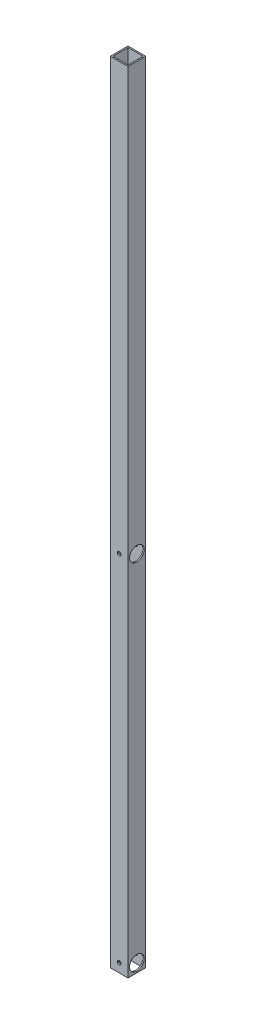
ISO-10303-21;
HEADER;
FILE_DESCRIPTION(('STEP AP214'),'2;1');
FILE_NAME('part.step','',(''),(''),'','','');
FILE_SCHEMA(('AUTOMOTIVE_DESIGN { 1 0 10303 214 1 1 1 1 }'));
ENDSEC;
DATA;
#1=APPLICATION_CONTEXT('core data for automotive mechanical design processes');
#2=APPLICATION_PROTOCOL_DEFINITION('international standard','automotive_design',2000,#1);
#3=PRODUCT_CONTEXT('',#1,'mechanical');
#4=PRODUCT('Part','Part','',(#3));
#5=PRODUCT_RELATED_PRODUCT_CATEGORY('part','',(#4));
#6=PRODUCT_DEFINITION_FORMATION('','',#4);
#7=PRODUCT_DEFINITION_CONTEXT('part definition',#1,'design');
#8=PRODUCT_DEFINITION('design','',#6,#7);
#9=PRODUCT_DEFINITION_SHAPE('','',#8);
#10=(LENGTH_UNIT() NAMED_UNIT(*) SI_UNIT(.MILLI.,.METRE.));
#11=(NAMED_UNIT(*) PLANE_ANGLE_UNIT() SI_UNIT($,.RADIAN.));
#12=(NAMED_UNIT(*) SI_UNIT($,.STERADIAN.) SOLID_ANGLE_UNIT());
#13=UNCERTAINTY_MEASURE_WITH_UNIT(LENGTH_MEASURE(1.E-05),#10,'distance_accuracy_value','');
#14=(GEOMETRIC_REPRESENTATION_CONTEXT(3) GLOBAL_UNCERTAINTY_ASSIGNED_CONTEXT((#13)) GLOBAL_UNIT_ASSIGNED_CONTEXT((#10,
#11,#12)) REPRESENTATION_CONTEXT('',''));
#15=CARTESIAN_POINT('',(0.,0.,0.));
#16=DIRECTION('',(0.,0.,1.));
#17=DIRECTION('',(1.,0.,0.));
#18=AXIS2_PLACEMENT_3D('',#15,#16,#17);
#19=CARTESIAN_POINT('',(22.225,22.225,0.));
#20=DIRECTION('',(0.,0.,1.));
#21=DIRECTION('',(1.,0.,0.));
#22=AXIS2_PLACEMENT_3D('',#19,#20,#21);
#23=CYLINDRICAL_SURFACE('',#22,4.7625);
#24=CARTESIAN_POINT('',(22.225,22.225,-41.275));
#25=DIRECTION('',(0.,0.,1.));
#26=DIRECTION('',(1.,0.,0.));
#27=AXIS2_PLACEMENT_3D('',#24,#25,#26);
#28=CIRCLE('',#27,4.7625);
#29=CARTESIAN_POINT('',(26.9875,22.225,-41.275));
#30=VERTEX_POINT('',#29);
#31=EDGE_CURVE('E123',#30,#30,#28,.F.);
#32=ORIENTED_EDGE('',*,*,#31,.F.);
#33=EDGE_LOOP('',(#32));
#34=FACE_BOUND('',#33,.T.);
#35=CARTESIAN_POINT('',(22.225,22.225,-44.45));
#36=DIRECTION('',(0.,0.,1.));
#37=DIRECTION('',(1.,0.,0.));
#38=AXIS2_PLACEMENT_3D('',#35,#36,#37);
#39=CIRCLE('',#38,4.7625);
#40=CARTESIAN_POINT('',(26.9875,22.225,-44.45));
#41=VERTEX_POINT('',#40);
#42=EDGE_CURVE('E20',#41,#41,#39,.T.);
#43=ORIENTED_EDGE('',*,*,#42,.F.);
#44=EDGE_LOOP('',(#43));
#45=FACE_BOUND('',#44,.T.);
#46=ADVANCED_FACE('F17',(#34,#45),#23,.F.);
#47=CARTESIAN_POINT('',(22.225,911.225,0.));
#48=DIRECTION('',(0.,0.,1.));
#49=DIRECTION('',(1.,0.,0.));
#50=AXIS2_PLACEMENT_3D('',#47,#48,#49);
#51=CYLINDRICAL_SURFACE('',#50,4.7625);
#52=CARTESIAN_POINT('',(22.225,911.225,-41.275));
#53=DIRECTION('',(0.,0.,1.));
#54=DIRECTION('',(1.,0.,0.));
#55=AXIS2_PLACEMENT_3D('',#52,#53,#54);
#56=CIRCLE('',#55,4.7625);
#57=CARTESIAN_POINT('',(26.9875,911.225,-41.275));
#58=VERTEX_POINT('',#57);
#59=EDGE_CURVE('E92',#58,#58,#56,.F.);
#60=ORIENTED_EDGE('',*,*,#59,.F.);
#61=EDGE_LOOP('',(#60));
#62=FACE_BOUND('',#61,.T.);
#63=CARTESIAN_POINT('',(22.225,911.225,-44.45));
#64=DIRECTION('',(0.,0.,1.));
#65=DIRECTION('',(1.,0.,0.));
#66=AXIS2_PLACEMENT_3D('',#63,#64,#65);
#67=CIRCLE('',#66,4.7625);
#68=CARTESIAN_POINT('',(26.9875,911.225,-44.45));
#69=VERTEX_POINT('',#68);
#70=EDGE_CURVE('E164',#69,#69,#67,.T.);
#71=ORIENTED_EDGE('',*,*,#70,.F.);
#72=EDGE_LOOP('',(#71));
#73=FACE_BOUND('',#72,.T.);
#74=ADVANCED_FACE('F175',(#62,#73),#51,.F.);
#75=CARTESIAN_POINT('',(44.45,22.225,-22.225));
#76=DIRECTION('',(1.,0.,0.));
#77=DIRECTION('',(0.,0.,-1.));
#78=AXIS2_PLACEMENT_3D('',#75,#76,#77);
#79=CYLINDRICAL_SURFACE('',#78,18.25625);
#80=CARTESIAN_POINT('',(41.275,22.225,-22.225));
#81=DIRECTION('',(1.,0.,0.));
#82=DIRECTION('',(0.,0.,-1.));
#83=AXIS2_PLACEMENT_3D('',#80,#81,#82);
#84=CIRCLE('',#83,18.25625);
#85=CARTESIAN_POINT('',(41.275,22.225,-40.48125));
#86=VERTEX_POINT('',#85);
#87=EDGE_CURVE('E162',#86,#86,#84,.T.);
#88=ORIENTED_EDGE('',*,*,#87,.F.);
#89=EDGE_LOOP('',(#88));
#90=FACE_BOUND('',#89,.T.);
#91=CARTESIAN_POINT('',(44.45,22.225,-22.225));
#92=DIRECTION('',(1.,0.,0.));
#93=DIRECTION('',(0.,0.,-1.));
#94=AXIS2_PLACEMENT_3D('',#91,#92,#93);
#95=CIRCLE('',#94,18.25625);
#96=CARTESIAN_POINT('',(44.45,22.225,-40.48125));
#97=VERTEX_POINT('',#96);
#98=EDGE_CURVE('E120',#97,#97,#95,.F.);
#99=ORIENTED_EDGE('',*,*,#98,.F.);
#100=EDGE_LOOP('',(#99));
#101=FACE_BOUND('',#100,.T.);
#102=ADVANCED_FACE('F181',(#90,#101),#79,.F.);
#103=CARTESIAN_POINT('',(44.45,911.225,-22.225));
#104=DIRECTION('',(1.,0.,0.));
#105=DIRECTION('',(0.,0.,-1.));
#106=AXIS2_PLACEMENT_3D('',#103,#104,#105);
#107=CYLINDRICAL_SURFACE('',#106,18.25625);
#108=CARTESIAN_POINT('',(41.275,911.225,-22.225));
#109=DIRECTION('',(1.,0.,0.));
#110=DIRECTION('',(0.,0.,-1.));
#111=AXIS2_PLACEMENT_3D('',#108,#109,#110);
#112=CIRCLE('',#111,18.25625);
#113=CARTESIAN_POINT('',(41.275,911.225,-40.48125));
#114=VERTEX_POINT('',#113);
#115=EDGE_CURVE('E159',#114,#114,#112,.T.);
#116=ORIENTED_EDGE('',*,*,#115,.F.);
#117=EDGE_LOOP('',(#116));
#118=FACE_BOUND('',#117,.T.);
#119=CARTESIAN_POINT('',(44.45,911.225,-22.225));
#120=DIRECTION('',(1.,0.,0.));
#121=DIRECTION('',(0.,0.,-1.));
#122=AXIS2_PLACEMENT_3D('',#119,#120,#121);
#123=CIRCLE('',#122,18.25625);
#124=CARTESIAN_POINT('',(44.45,911.225,-40.48125));
#125=VERTEX_POINT('',#124);
#126=EDGE_CURVE('E116',#125,#125,#123,.F.);
#127=ORIENTED_EDGE('',*,*,#126,.F.);
#128=EDGE_LOOP('',(#127));
#129=FACE_BOUND('',#128,.T.);
#130=ADVANCED_FACE('F237',(#118,#129),#107,.F.);
#131=CARTESIAN_POINT('',(44.45,22.225,-22.225));
#132=DIRECTION('',(1.,0.,0.));
#133=DIRECTION('',(0.,0.,-1.));
#134=AXIS2_PLACEMENT_3D('',#131,#132,#133);
#135=CYLINDRICAL_SURFACE('',#134,18.25625);
#136=CARTESIAN_POINT('',(3.175,22.225,-22.225));
#137=DIRECTION('',(1.,0.,0.));
#138=DIRECTION('',(0.,0.,-1.));
#139=AXIS2_PLACEMENT_3D('',#136,#137,#138);
#140=CIRCLE('',#139,18.25625);
#141=CARTESIAN_POINT('',(3.175,22.225,-40.48125));
#142=VERTEX_POINT('',#141);
#143=EDGE_CURVE('E156',#142,#142,#140,.F.);
#144=ORIENTED_EDGE('',*,*,#143,.F.);
#145=EDGE_LOOP('',(#144));
#146=FACE_BOUND('',#145,.T.);
#147=CARTESIAN_POINT('',(0.,22.225,-22.225));
#148=DIRECTION('',(1.,0.,0.));
#149=DIRECTION('',(0.,0.,-1.));
#150=AXIS2_PLACEMENT_3D('',#147,#148,#149);
#151=CIRCLE('',#150,18.25625);
#152=CARTESIAN_POINT('',(0.,22.225,-40.48125));
#153=VERTEX_POINT('',#152);
#154=EDGE_CURVE('E142',#153,#153,#151,.T.);
#155=ORIENTED_EDGE('',*,*,#154,.F.);
#156=EDGE_LOOP('',(#155));
#157=FACE_BOUND('',#156,.T.);
#158=ADVANCED_FACE('F233',(#146,#157),#135,.F.);
#159=CARTESIAN_POINT('',(44.45,911.225,-22.225));
#160=DIRECTION('',(1.,0.,0.));
#161=DIRECTION('',(0.,0.,-1.));
#162=AXIS2_PLACEMENT_3D('',#159,#160,#161);
#163=CYLINDRICAL_SURFACE('',#162,18.25625);
#164=CARTESIAN_POINT('',(3.175,911.225,-22.225));
#165=DIRECTION('',(1.,0.,0.));
#166=DIRECTION('',(0.,0.,-1.));
#167=AXIS2_PLACEMENT_3D('',#164,#165,#166);
#168=CIRCLE('',#167,18.25625);
#169=CARTESIAN_POINT('',(3.175,911.225,-40.48125));
#170=VERTEX_POINT('',#169);
#171=EDGE_CURVE('E125',#170,#170,#168,.F.);
#172=ORIENTED_EDGE('',*,*,#171,.F.);
#173=EDGE_LOOP('',(#172));
#174=FACE_BOUND('',#173,.T.);
#175=CARTESIAN_POINT('',(0.,911.225,-22.225));
#176=DIRECTION('',(1.,0.,0.));
#177=DIRECTION('',(0.,0.,-1.));
#178=AXIS2_PLACEMENT_3D('',#175,#176,#177);
#179=CIRCLE('',#178,18.25625);
#180=CARTESIAN_POINT('',(0.,911.225,-40.48125));
#181=VERTEX_POINT('',#180);
#182=EDGE_CURVE('E138',#181,#181,#179,.T.);
#183=ORIENTED_EDGE('',*,*,#182,.F.);
#184=EDGE_LOOP('',(#183));
#185=FACE_BOUND('',#184,.T.);
#186=ADVANCED_FACE('F230',(#174,#185),#163,.F.);
#187=CARTESIAN_POINT('',(44.45,0.,-44.45));
#188=DIRECTION('',(0.,0.,-1.));
#189=DIRECTION('',(-1.,0.,0.));
#190=AXIS2_PLACEMENT_3D('',#187,#188,#189);
#191=PLANE('',#190);
#192=ORIENTED_EDGE('',*,*,#70,.T.);
#193=EDGE_LOOP('',(#192));
#194=FACE_BOUND('',#193,.T.);
#195=ORIENTED_EDGE('',*,*,#42,.T.);
#196=EDGE_LOOP('',(#195));
#197=FACE_BOUND('',#196,.T.);
#198=DIRECTION('',(0.,1.,0.));
#199=VECTOR('',#198,1.);
#200=CARTESIAN_POINT('',(44.45,0.,-44.45));
#201=LINE('',#200,#199);
#202=CARTESIAN_POINT('',(44.45,0.,-44.45));
#203=VERTEX_POINT('',#202);
#204=CARTESIAN_POINT('',(44.45,1981.2,-44.45));
#205=VERTEX_POINT('',#204);
#206=EDGE_CURVE('E117',#203,#205,#201,.T.);
#207=ORIENTED_EDGE('',*,*,#206,.F.);
#208=DIRECTION('',(1.,0.,0.));
#209=VECTOR('',#208,1.);
#210=CARTESIAN_POINT('',(0.,0.,-44.45));
#211=LINE('',#210,#209);
#212=CARTESIAN_POINT('',(0.,0.,-44.45));
#213=VERTEX_POINT('',#212);
#214=EDGE_CURVE('E263',#203,#213,#211,.F.);
#215=ORIENTED_EDGE('',*,*,#214,.T.);
#216=DIRECTION('',(0.,1.,0.));
#217=VECTOR('',#216,1.);
#218=CARTESIAN_POINT('',(0.,0.,-44.45));
#219=LINE('',#218,#217);
#220=CARTESIAN_POINT('',(0.,1981.2,-44.45));
#221=VERTEX_POINT('',#220);
#222=EDGE_CURVE('E145',#221,#213,#219,.F.);
#223=ORIENTED_EDGE('',*,*,#222,.F.);
#224=DIRECTION('',(1.,0.,0.));
#225=VECTOR('',#224,1.);
#226=CARTESIAN_POINT('',(0.,1981.2,-44.45));
#227=LINE('',#226,#225);
#228=EDGE_CURVE('E108',#205,#221,#227,.F.);
#229=ORIENTED_EDGE('',*,*,#228,.F.);
#230=EDGE_LOOP('',(#207,#215,#223,#229));
#231=FACE_BOUND('',#230,.T.);
#232=ADVANCED_FACE('F171',(#194,#197,#231),#191,.T.);
#233=CARTESIAN_POINT('',(41.275,0.,-41.275));
#234=DIRECTION('',(-1.,0.,0.));
#235=DIRECTION('',(0.,0.,1.));
#236=AXIS2_PLACEMENT_3D('',#233,#234,#235);
#237=PLANE('',#236);
#238=ORIENTED_EDGE('',*,*,#115,.T.);
#239=EDGE_LOOP('',(#238));
#240=FACE_BOUND('',#239,.T.);
#241=ORIENTED_EDGE('',*,*,#87,.T.);
#242=EDGE_LOOP('',(#241));
#243=FACE_BOUND('',#242,.T.);
#244=DIRECTION('',(0.,1.,0.));
#245=VECTOR('',#244,1.);
#246=CARTESIAN_POINT('',(41.275,0.,-41.275));
#247=LINE('',#246,#245);
#248=CARTESIAN_POINT('',(41.275,0.,-41.275));
#249=VERTEX_POINT('',#248);
#250=CARTESIAN_POINT('',(41.275,1981.2,-41.275));
#251=VERTEX_POINT('',#250);
#252=EDGE_CURVE('E124',#249,#251,#247,.T.);
#253=ORIENTED_EDGE('',*,*,#252,.F.);
#254=DIRECTION('',(0.,0.,1.));
#255=VECTOR('',#254,1.);
#256=CARTESIAN_POINT('',(41.275,0.,0.));
#257=LINE('',#256,#255);
#258=CARTESIAN_POINT('',(41.275,0.,-3.175));
#259=VERTEX_POINT('',#258);
#260=EDGE_CURVE('E275',#249,#259,#257,.T.);
#261=ORIENTED_EDGE('',*,*,#260,.T.);
#262=DIRECTION('',(0.,1.,0.));
#263=VECTOR('',#262,1.);
#264=CARTESIAN_POINT('',(41.275,0.,-3.175));
#265=LINE('',#264,#263);
#266=CARTESIAN_POINT('',(41.275,1981.2,-3.175));
#267=VERTEX_POINT('',#266);
#268=EDGE_CURVE('E91',#267,#259,#265,.F.);
#269=ORIENTED_EDGE('',*,*,#268,.F.);
#270=DIRECTION('',(0.,0.,1.));
#271=VECTOR('',#270,1.);
#272=CARTESIAN_POINT('',(41.275,1981.2,0.));
#273=LINE('',#272,#271);
#274=EDGE_CURVE('E107',#251,#267,#273,.T.);
#275=ORIENTED_EDGE('',*,*,#274,.F.);
#276=EDGE_LOOP('',(#253,#261,#269,#275));
#277=FACE_BOUND('',#276,.T.);
#278=ADVANCED_FACE('F223',(#240,#243,#277),#237,.T.);
#279=CARTESIAN_POINT('',(3.175,0.,-3.175));
#280=DIRECTION('',(1.,0.,0.));
#281=DIRECTION('',(0.,0.,-1.));
#282=AXIS2_PLACEMENT_3D('',#279,#280,#281);
#283=PLANE('',#282);
#284=ORIENTED_EDGE('',*,*,#171,.T.);
#285=EDGE_LOOP('',(#284));
#286=FACE_BOUND('',#285,.T.);
#287=ORIENTED_EDGE('',*,*,#143,.T.);
#288=EDGE_LOOP('',(#287));
#289=FACE_BOUND('',#288,.T.);
#290=DIRECTION('',(0.,1.,0.));
#291=VECTOR('',#290,1.);
#292=CARTESIAN_POINT('',(3.175,0.,-3.175));
#293=LINE('',#292,#291);
#294=CARTESIAN_POINT('',(3.175,0.,-3.175));
#295=VERTEX_POINT('',#294);
#296=CARTESIAN_POINT('',(3.175,1981.2,-3.175));
#297=VERTEX_POINT('',#296);
#298=EDGE_CURVE('E80',#295,#297,#293,.T.);
#299=ORIENTED_EDGE('',*,*,#298,.F.);
#300=DIRECTION('',(0.,0.,1.));
#301=VECTOR('',#300,1.);
#302=CARTESIAN_POINT('',(3.175,0.,0.));
#303=LINE('',#302,#301);
#304=CARTESIAN_POINT('',(3.175,0.,-41.275));
#305=VERTEX_POINT('',#304);
#306=EDGE_CURVE('E272',#295,#305,#303,.F.);
#307=ORIENTED_EDGE('',*,*,#306,.T.);
#308=DIRECTION('',(0.,1.,0.));
#309=VECTOR('',#308,1.);
#310=CARTESIAN_POINT('',(3.175,0.,-41.275));
#311=LINE('',#310,#309);
#312=CARTESIAN_POINT('',(3.175,1981.2,-41.275));
#313=VERTEX_POINT('',#312);
#314=EDGE_CURVE('E98',#313,#305,#311,.F.);
#315=ORIENTED_EDGE('',*,*,#314,.F.);
#316=DIRECTION('',(0.,0.,1.));
#317=VECTOR('',#316,1.);
#318=CARTESIAN_POINT('',(3.175,1981.2,0.));
#319=LINE('',#318,#317);
#320=EDGE_CURVE('E95',#297,#313,#319,.F.);
#321=ORIENTED_EDGE('',*,*,#320,.F.);
#322=EDGE_LOOP('',(#299,#307,#315,#321));
#323=FACE_BOUND('',#322,.T.);
#324=ADVANCED_FACE('F96',(#286,#289,#323),#283,.T.);
#325=CARTESIAN_POINT('',(3.175,0.,-41.275));
#326=DIRECTION('',(0.,0.,1.));
#327=DIRECTION('',(1.,0.,0.));
#328=AXIS2_PLACEMENT_3D('',#325,#326,#327);
#329=PLANE('',#328);
#330=ORIENTED_EDGE('',*,*,#59,.T.);
#331=EDGE_LOOP('',(#330));
#332=FACE_BOUND('',#331,.T.);
#333=ORIENTED_EDGE('',*,*,#31,.T.);
#334=EDGE_LOOP('',(#333));
#335=FACE_BOUND('',#334,.T.);
#336=ORIENTED_EDGE('',*,*,#314,.T.);
#337=DIRECTION('',(1.,0.,0.));
#338=VECTOR('',#337,1.);
#339=CARTESIAN_POINT('',(0.,0.,-41.275));
#340=LINE('',#339,#338);
#341=EDGE_CURVE('E137',#305,#249,#340,.T.);
#342=ORIENTED_EDGE('',*,*,#341,.T.);
#343=ORIENTED_EDGE('',*,*,#252,.T.);
#344=DIRECTION('',(1.,0.,0.));
#345=VECTOR('',#344,1.);
#346=CARTESIAN_POINT('',(0.,1981.2,-41.275));
#347=LINE('',#346,#345);
#348=EDGE_CURVE('E102',#313,#251,#347,.T.);
#349=ORIENTED_EDGE('',*,*,#348,.F.);
#350=EDGE_LOOP('',(#336,#342,#343,#349));
#351=FACE_BOUND('',#350,.T.);
#352=ADVANCED_FACE('F216',(#332,#335,#351),#329,.T.);
#353=CARTESIAN_POINT('',(41.275,0.,-3.175));
#354=DIRECTION('',(0.,0.,-1.));
#355=DIRECTION('',(-1.,0.,0.));
#356=AXIS2_PLACEMENT_3D('',#353,#354,#355);
#357=PLANE('',#356);
#358=CARTESIAN_POINT('',(22.225,911.225,-3.175));
#359=DIRECTION('',(0.,0.,1.));
#360=DIRECTION('',(1.,0.,0.));
#361=AXIS2_PLACEMENT_3D('',#358,#359,#360);
#362=CIRCLE('',#361,4.7625);
#363=CARTESIAN_POINT('',(26.9875,911.225,-3.175));
#364=VERTEX_POINT('',#363);
#365=EDGE_CURVE('E130',#364,#364,#362,.T.);
#366=ORIENTED_EDGE('',*,*,#365,.T.);
#367=EDGE_LOOP('',(#366));
#368=FACE_BOUND('',#367,.T.);
#369=CARTESIAN_POINT('',(22.225,22.225,-3.175));
#370=DIRECTION('',(0.,0.,1.));
#371=DIRECTION('',(1.,0.,0.));
#372=AXIS2_PLACEMENT_3D('',#369,#370,#371);
#373=CIRCLE('',#372,4.7625);
#374=CARTESIAN_POINT('',(26.9875,22.225,-3.175));
#375=VERTEX_POINT('',#374);
#376=EDGE_CURVE('E134',#375,#375,#373,.T.);
#377=ORIENTED_EDGE('',*,*,#376,.T.);
#378=EDGE_LOOP('',(#377));
#379=FACE_BOUND('',#378,.T.);
#380=ORIENTED_EDGE('',*,*,#268,.T.);
#381=DIRECTION('',(1.,0.,0.));
#382=VECTOR('',#381,1.);
#383=CARTESIAN_POINT('',(0.,0.,-3.175));
#384=LINE('',#383,#382);
#385=EDGE_CURVE('E88',#259,#295,#384,.F.);
#386=ORIENTED_EDGE('',*,*,#385,.T.);
#387=ORIENTED_EDGE('',*,*,#298,.T.);
#388=DIRECTION('',(1.,0.,0.));
#389=VECTOR('',#388,1.);
#390=CARTESIAN_POINT('',(0.,1981.2,-3.175));
#391=LINE('',#390,#389);
#392=EDGE_CURVE('E85',#267,#297,#391,.F.);
#393=ORIENTED_EDGE('',*,*,#392,.F.);
#394=EDGE_LOOP('',(#380,#386,#387,#393));
#395=FACE_BOUND('',#394,.T.);
#396=ADVANCED_FACE('F83',(#368,#379,#395),#357,.T.);
#397=CARTESIAN_POINT('',(44.45,0.,0.));
#398=DIRECTION('',(1.,0.,0.));
#399=DIRECTION('',(0.,0.,-1.));
#400=AXIS2_PLACEMENT_3D('',#397,#398,#399);
#401=PLANE('',#400);
#402=ORIENTED_EDGE('',*,*,#126,.T.);
#403=EDGE_LOOP('',(#402));
#404=FACE_BOUND('',#403,.T.);
#405=ORIENTED_EDGE('',*,*,#98,.T.);
#406=EDGE_LOOP('',(#405));
#407=FACE_BOUND('',#406,.T.);
#408=DIRECTION('',(0.,1.,0.));
#409=VECTOR('',#408,1.);
#410=CARTESIAN_POINT('',(44.45,0.,0.));
#411=LINE('',#410,#409);
#412=CARTESIAN_POINT('',(44.45,0.,0.));
#413=VERTEX_POINT('',#412);
#414=CARTESIAN_POINT('',(44.45,1981.2,0.));
#415=VERTEX_POINT('',#414);
#416=EDGE_CURVE('E133',#413,#415,#411,.T.);
#417=ORIENTED_EDGE('',*,*,#416,.F.);
#418=DIRECTION('',(0.,0.,1.));
#419=VECTOR('',#418,1.);
#420=CARTESIAN_POINT('',(44.45,0.,0.));
#421=LINE('',#420,#419);
#422=EDGE_CURVE('E141',#413,#203,#421,.F.);
#423=ORIENTED_EDGE('',*,*,#422,.T.);
#424=ORIENTED_EDGE('',*,*,#206,.T.);
#425=DIRECTION('',(0.,0.,1.));
#426=VECTOR('',#425,1.);
#427=CARTESIAN_POINT('',(44.45,1981.2,0.));
#428=LINE('',#427,#426);
#429=EDGE_CURVE('E110',#415,#205,#428,.F.);
#430=ORIENTED_EDGE('',*,*,#429,.F.);
#431=EDGE_LOOP('',(#417,#423,#424,#430));
#432=FACE_BOUND('',#431,.T.);
#433=ADVANCED_FACE('F210',(#404,#407,#432),#401,.T.);
#434=CARTESIAN_POINT('',(0.,1981.2,0.));
#435=DIRECTION('',(0.,1.,0.));
#436=DIRECTION('',(0.,0.,1.));
#437=AXIS2_PLACEMENT_3D('',#434,#435,#436);
#438=PLANE('',#437);
#439=ORIENTED_EDGE('',*,*,#348,.T.);
#440=ORIENTED_EDGE('',*,*,#274,.T.);
#441=ORIENTED_EDGE('',*,*,#392,.T.);
#442=ORIENTED_EDGE('',*,*,#320,.T.);
#443=EDGE_LOOP('',(#439,#440,#441,#442));
#444=FACE_BOUND('',#443,.T.);
#445=DIRECTION('',(0.,0.,1.));
#446=VECTOR('',#445,1.);
#447=CARTESIAN_POINT('',(0.,1981.2,-44.45));
#448=LINE('',#447,#446);
#449=CARTESIAN_POINT('',(0.,1981.2,0.));
#450=VERTEX_POINT('',#449);
#451=EDGE_CURVE('E280',#450,#221,#448,.F.);
#452=ORIENTED_EDGE('',*,*,#451,.F.);
#453=DIRECTION('',(1.,0.,0.));
#454=VECTOR('',#453,1.);
#455=CARTESIAN_POINT('',(0.,1981.2,0.));
#456=LINE('',#455,#454);
#457=EDGE_CURVE('E259',#415,#450,#456,.F.);
#458=ORIENTED_EDGE('',*,*,#457,.F.);
#459=ORIENTED_EDGE('',*,*,#429,.T.);
#460=ORIENTED_EDGE('',*,*,#228,.T.);
#461=EDGE_LOOP('',(#452,#458,#459,#460));
#462=FACE_BOUND('',#461,.T.);
#463=ADVANCED_FACE('F104',(#444,#462),#438,.T.);
#464=CARTESIAN_POINT('',(0.,0.,-44.45));
#465=DIRECTION('',(-1.,0.,0.));
#466=DIRECTION('',(0.,0.,1.));
#467=AXIS2_PLACEMENT_3D('',#464,#465,#466);
#468=PLANE('',#467);
#469=ORIENTED_EDGE('',*,*,#182,.T.);
#470=EDGE_LOOP('',(#469));
#471=FACE_BOUND('',#470,.T.);
#472=ORIENTED_EDGE('',*,*,#154,.T.);
#473=EDGE_LOOP('',(#472));
#474=FACE_BOUND('',#473,.T.);
#475=ORIENTED_EDGE('',*,*,#222,.T.);
#476=DIRECTION('',(0.,0.,1.));
#477=VECTOR('',#476,1.);
#478=CARTESIAN_POINT('',(0.,0.,0.));
#479=LINE('',#478,#477);
#480=CARTESIAN_POINT('',(0.,0.,0.));
#481=VERTEX_POINT('',#480);
#482=EDGE_CURVE('E35',#213,#481,#479,.T.);
#483=ORIENTED_EDGE('',*,*,#482,.T.);
#484=DIRECTION('',(0.,1.,0.));
#485=VECTOR('',#484,1.);
#486=CARTESIAN_POINT('',(0.,0.,0.));
#487=LINE('',#486,#485);
#488=EDGE_CURVE('E265',#450,#481,#487,.F.);
#489=ORIENTED_EDGE('',*,*,#488,.F.);
#490=ORIENTED_EDGE('',*,*,#451,.T.);
#491=EDGE_LOOP('',(#475,#483,#489,#490));
#492=FACE_BOUND('',#491,.T.);
#493=ADVANCED_FACE('F203',(#471,#474,#492),#468,.T.);
#494=CARTESIAN_POINT('',(0.,0.,0.));
#495=DIRECTION('',(0.,1.,0.));
#496=DIRECTION('',(0.,0.,1.));
#497=AXIS2_PLACEMENT_3D('',#494,#495,#496);
#498=PLANE('',#497);
#499=ORIENTED_EDGE('',*,*,#306,.F.);
#500=ORIENTED_EDGE('',*,*,#385,.F.);
#501=ORIENTED_EDGE('',*,*,#260,.F.);
#502=ORIENTED_EDGE('',*,*,#341,.F.);
#503=EDGE_LOOP('',(#499,#500,#501,#502));
#504=FACE_BOUND('',#503,.T.);
#505=ORIENTED_EDGE('',*,*,#214,.F.);
#506=ORIENTED_EDGE('',*,*,#422,.F.);
#507=DIRECTION('',(1.,0.,0.));
#508=VECTOR('',#507,1.);
#509=CARTESIAN_POINT('',(0.,0.,0.));
#510=LINE('',#509,#508);
#511=EDGE_CURVE('E129',#481,#413,#510,.T.);
#512=ORIENTED_EDGE('',*,*,#511,.F.);
#513=ORIENTED_EDGE('',*,*,#482,.F.);
#514=EDGE_LOOP('',(#505,#506,#512,#513));
#515=FACE_BOUND('',#514,.T.);
#516=ADVANCED_FACE('F199',(#504,#515),#498,.F.);
#517=CARTESIAN_POINT('',(22.225,22.225,0.));
#518=DIRECTION('',(0.,0.,1.));
#519=DIRECTION('',(1.,0.,0.));
#520=AXIS2_PLACEMENT_3D('',#517,#518,#519);
#521=CYLINDRICAL_SURFACE('',#520,4.7625);
#522=ORIENTED_EDGE('',*,*,#376,.F.);
#523=EDGE_LOOP('',(#522));
#524=FACE_BOUND('',#523,.T.);
#525=CARTESIAN_POINT('',(22.225,22.225,0.));
#526=DIRECTION('',(0.,0.,1.));
#527=DIRECTION('',(1.,0.,0.));
#528=AXIS2_PLACEMENT_3D('',#525,#526,#527);
#529=CIRCLE('',#528,4.7625);
#530=CARTESIAN_POINT('',(26.9875,22.225,0.));
#531=VERTEX_POINT('',#530);
#532=EDGE_CURVE('E26',#531,#531,#529,.F.);
#533=ORIENTED_EDGE('',*,*,#532,.F.);
#534=EDGE_LOOP('',(#533));
#535=FACE_BOUND('',#534,.T.);
#536=ADVANCED_FACE('F192',(#524,#535),#521,.F.);
#537=CARTESIAN_POINT('',(22.225,911.225,0.));
#538=DIRECTION('',(0.,0.,1.));
#539=DIRECTION('',(1.,0.,0.));
#540=AXIS2_PLACEMENT_3D('',#537,#538,#539);
#541=CYLINDRICAL_SURFACE('',#540,4.7625);
#542=ORIENTED_EDGE('',*,*,#365,.F.);
#543=EDGE_LOOP('',(#542));
#544=FACE_BOUND('',#543,.T.);
#545=CARTESIAN_POINT('',(22.225,911.225,0.));
#546=DIRECTION('',(0.,0.,1.));
#547=DIRECTION('',(1.,0.,0.));
#548=AXIS2_PLACEMENT_3D('',#545,#546,#547);
#549=CIRCLE('',#548,4.7625);
#550=CARTESIAN_POINT('',(26.9875,911.225,0.));
#551=VERTEX_POINT('',#550);
#552=EDGE_CURVE('E11',#551,#551,#549,.F.);
#553=ORIENTED_EDGE('',*,*,#552,.F.);
#554=EDGE_LOOP('',(#553));
#555=FACE_BOUND('',#554,.T.);
#556=ADVANCED_FACE('F186',(#544,#555),#541,.F.);
#557=CARTESIAN_POINT('',(0.,0.,0.));
#558=DIRECTION('',(0.,0.,1.));
#559=DIRECTION('',(1.,0.,0.));
#560=AXIS2_PLACEMENT_3D('',#557,#558,#559);
#561=PLANE('',#560);
#562=ORIENTED_EDGE('',*,*,#552,.T.);
#563=EDGE_LOOP('',(#562));
#564=FACE_BOUND('',#563,.T.);
#565=ORIENTED_EDGE('',*,*,#532,.T.);
#566=EDGE_LOOP('',(#565));
#567=FACE_BOUND('',#566,.T.);
#568=ORIENTED_EDGE('',*,*,#488,.T.);
#569=ORIENTED_EDGE('',*,*,#511,.T.);
#570=ORIENTED_EDGE('',*,*,#416,.T.);
#571=ORIENTED_EDGE('',*,*,#457,.T.);
#572=EDGE_LOOP('',(#568,#569,#570,#571));
#573=FACE_BOUND('',#572,.T.);
#574=ADVANCED_FACE('F184',(#564,#567,#573),#561,.T.);
#575=CLOSED_SHELL('',(#46,#74,#102,#130,#158,#186,#232,#278,#324,#352,#396,#433,#463,#493,#516,
#536,#556,#574));
#576=MANIFOLD_SOLID_BREP('B1',#575);
#577=ADVANCED_BREP_SHAPE_REPRESENTATION('',(#18,#576),#14);
#578=SHAPE_DEFINITION_REPRESENTATION(#9,#577);
ENDSEC;
END-ISO-10303-21;
